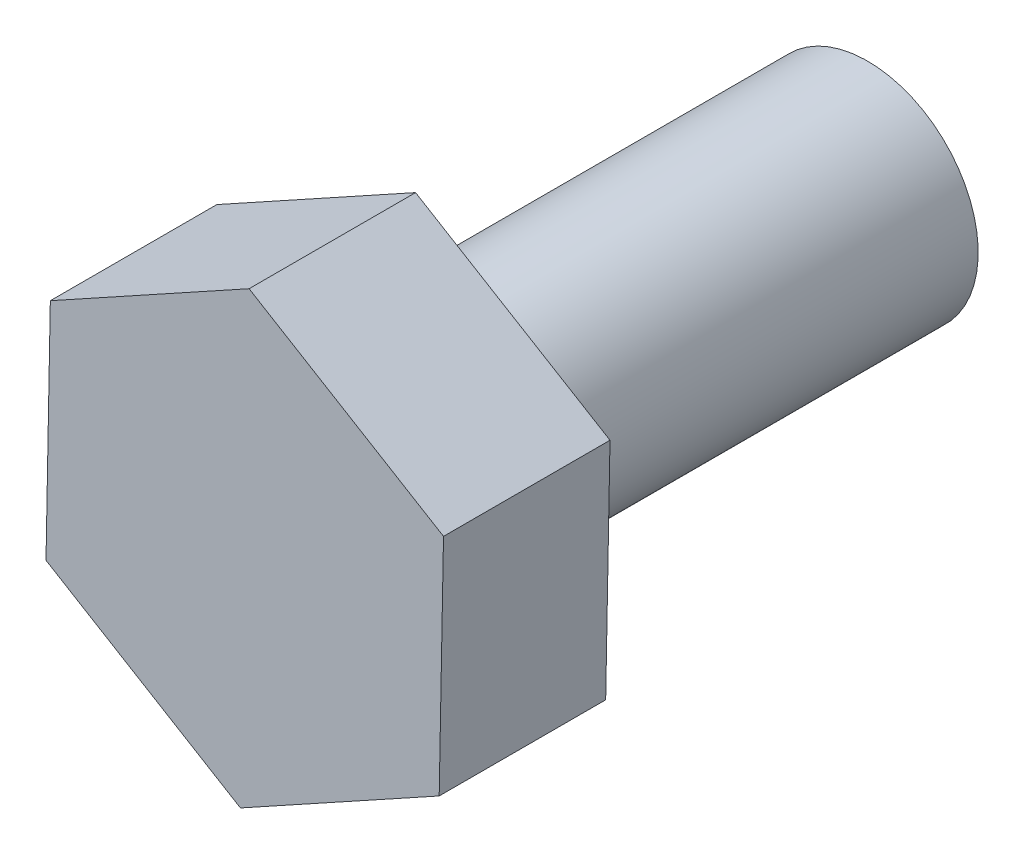
ISO-10303-21;
HEADER;
FILE_DESCRIPTION(('STEP AP214'),'2;1');
FILE_NAME('part.step','',(''),(''),'','','');
FILE_SCHEMA(('AUTOMOTIVE_DESIGN { 1 0 10303 214 1 1 1 1 }'));
ENDSEC;
DATA;
#1=APPLICATION_CONTEXT('core data for automotive mechanical design processes');
#2=APPLICATION_PROTOCOL_DEFINITION('international standard','automotive_design',2000,#1);
#3=PRODUCT_CONTEXT('',#1,'mechanical');
#4=PRODUCT('Part','Part','',(#3));
#5=PRODUCT_RELATED_PRODUCT_CATEGORY('part','',(#4));
#6=PRODUCT_DEFINITION_FORMATION('','',#4);
#7=PRODUCT_DEFINITION_CONTEXT('part definition',#1,'design');
#8=PRODUCT_DEFINITION('design','',#6,#7);
#9=PRODUCT_DEFINITION_SHAPE('','',#8);
#10=(LENGTH_UNIT() NAMED_UNIT(*) SI_UNIT(.MILLI.,.METRE.));
#11=(NAMED_UNIT(*) PLANE_ANGLE_UNIT() SI_UNIT($,.RADIAN.));
#12=(NAMED_UNIT(*) SI_UNIT($,.STERADIAN.) SOLID_ANGLE_UNIT());
#13=UNCERTAINTY_MEASURE_WITH_UNIT(LENGTH_MEASURE(1.E-05),#10,'distance_accuracy_value','');
#14=(GEOMETRIC_REPRESENTATION_CONTEXT(3) GLOBAL_UNCERTAINTY_ASSIGNED_CONTEXT((#13)) GLOBAL_UNIT_ASSIGNED_CONTEXT((#10,
#11,#12)) REPRESENTATION_CONTEXT('',''));
#15=CARTESIAN_POINT('',(0.,0.,0.));
#16=DIRECTION('',(0.,0.,1.));
#17=DIRECTION('',(1.,0.,0.));
#18=AXIS2_PLACEMENT_3D('',#15,#16,#17);
#19=CARTESIAN_POINT('',(-0.0811230383379181,-3.87413281363667,-2.9));
#20=DIRECTION('',(0.483401221702302,-0.875398914128137,0.));
#21=DIRECTION('',(0.875398914128137,0.483401221702302,0.));
#22=AXIS2_PLACEMENT_3D('',#19,#20,#21);
#23=PLANE('',#22);
#24=DIRECTION('',(0.875398914128137,0.483401221702302,0.));
#25=VECTOR('',#24,1.);
#26=CARTESIAN_POINT('',(-0.0811230383379181,-3.87413281363667,0.));
#27=LINE('',#26,#25);
#28=CARTESIAN_POINT('',(-0.0811230383379181,-3.87413281363667,0.));
#29=VERTEX_POINT('',#28);
#30=CARTESIAN_POINT('',(3.38094778289536,-1.96235380912321,0.));
#31=VERTEX_POINT('',#30);
#32=EDGE_CURVE('E132',#29,#31,#27,.T.);
#33=ORIENTED_EDGE('',*,*,#32,.F.);
#34=DIRECTION('',(0.,0.,1.));
#35=VECTOR('',#34,1.);
#36=CARTESIAN_POINT('',(-0.0811230383379181,-3.87413281363667,-2.9));
#37=LINE('',#36,#35);
#38=CARTESIAN_POINT('',(-0.0811230383379181,-3.87413281363667,-2.9));
#39=VERTEX_POINT('',#38);
#40=EDGE_CURVE('E49',#39,#29,#37,.T.);
#41=ORIENTED_EDGE('',*,*,#40,.F.);
#42=DIRECTION('',(0.875398914128137,0.483401221702302,0.));
#43=VECTOR('',#42,1.);
#44=CARTESIAN_POINT('',(-0.0811230383379181,-3.87413281363667,-2.9));
#45=LINE('',#44,#43);
#46=CARTESIAN_POINT('',(3.38094778289536,-1.96235380912321,-2.9));
#47=VERTEX_POINT('',#46);
#48=EDGE_CURVE('E154',#39,#47,#45,.T.);
#49=ORIENTED_EDGE('',*,*,#48,.T.);
#50=DIRECTION('',(0.,0.,1.));
#51=VECTOR('',#50,1.);
#52=CARTESIAN_POINT('',(3.38094778289536,-1.96235380912321,-2.9));
#53=LINE('',#52,#51);
#54=EDGE_CURVE('E42',#47,#31,#53,.T.);
#55=ORIENTED_EDGE('',*,*,#54,.T.);
#56=EDGE_LOOP('',(#33,#41,#49,#55));
#57=FACE_BOUND('',#56,.T.);
#58=ADVANCED_FACE('F39',(#57),#23,.T.);
#59=CARTESIAN_POINT('',(-3.46780763328494,-1.83178103500453,-2.9));
#60=DIRECTION('',(-0.516417087229128,-0.856337195278696,0.));
#61=DIRECTION('',(0.856337195278696,-0.516417087229128,0.));
#62=AXIS2_PLACEMENT_3D('',#59,#60,#61);
#63=PLANE('',#62);
#64=DIRECTION('',(0.856337195278695,-0.516417087229128,0.));
#65=VECTOR('',#64,1.);
#66=CARTESIAN_POINT('',(-3.46780763328494,-1.83178103500453,0.));
#67=LINE('',#66,#65);
#68=CARTESIAN_POINT('',(-3.46780763328494,-1.83178103500453,0.));
#69=VERTEX_POINT('',#68);
#70=EDGE_CURVE('E150',#69,#29,#67,.T.);
#71=ORIENTED_EDGE('',*,*,#70,.F.);
#72=DIRECTION('',(0.,0.,1.));
#73=VECTOR('',#72,1.);
#74=CARTESIAN_POINT('',(-3.46780763328494,-1.83178103500453,-2.9));
#75=LINE('',#74,#73);
#76=CARTESIAN_POINT('',(-3.46780763328494,-1.83178103500453,-2.9));
#77=VERTEX_POINT('',#76);
#78=EDGE_CURVE('E80',#77,#69,#75,.T.);
#79=ORIENTED_EDGE('',*,*,#78,.F.);
#80=DIRECTION('',(0.856337195278695,-0.516417087229128,0.));
#81=VECTOR('',#80,1.);
#82=CARTESIAN_POINT('',(-3.46780763328494,-1.83178103500453,-2.9));
#83=LINE('',#82,#81);
#84=EDGE_CURVE('E118',#77,#39,#83,.T.);
#85=ORIENTED_EDGE('',*,*,#84,.T.);
#86=ORIENTED_EDGE('',*,*,#40,.T.);
#87=EDGE_LOOP('',(#71,#79,#85,#86));
#88=FACE_BOUND('',#87,.T.);
#89=ADVANCED_FACE('F167',(#88),#63,.T.);
#90=CARTESIAN_POINT('',(-3.39242140699869,2.12234974814107,-2.9));
#91=DIRECTION('',(-0.99981830893143,0.0190617188494415,0.));
#92=DIRECTION('',(-0.0190617188494415,-0.99981830893143,0.));
#93=AXIS2_PLACEMENT_3D('',#90,#91,#92);
#94=PLANE('',#93);
#95=DIRECTION('',(-0.0190617188494415,-0.99981830893143,0.));
#96=VECTOR('',#95,1.);
#97=CARTESIAN_POINT('',(-3.39242140699869,2.12234974814107,0.));
#98=LINE('',#97,#96);
#99=CARTESIAN_POINT('',(-3.39242140699869,2.12234974814107,0.));
#100=VERTEX_POINT('',#99);
#101=EDGE_CURVE('E104',#100,#69,#98,.T.);
#102=ORIENTED_EDGE('',*,*,#101,.F.);
#103=DIRECTION('',(0.,0.,1.));
#104=VECTOR('',#103,1.);
#105=CARTESIAN_POINT('',(-3.39242140699869,2.12234974814107,-2.9));
#106=LINE('',#105,#104);
#107=CARTESIAN_POINT('',(-3.39242140699869,2.12234974814107,-2.9));
#108=VERTEX_POINT('',#107);
#109=EDGE_CURVE('E99',#108,#100,#106,.T.);
#110=ORIENTED_EDGE('',*,*,#109,.F.);
#111=DIRECTION('',(-0.0190617188494415,-0.99981830893143,0.));
#112=VECTOR('',#111,1.);
#113=CARTESIAN_POINT('',(-3.39242140699869,2.12234974814107,-2.9));
#114=LINE('',#113,#112);
#115=EDGE_CURVE('E102',#108,#77,#114,.T.);
#116=ORIENTED_EDGE('',*,*,#115,.T.);
#117=ORIENTED_EDGE('',*,*,#78,.T.);
#118=EDGE_LOOP('',(#102,#110,#116,#117));
#119=FACE_BOUND('',#118,.T.);
#120=ADVANCED_FACE('F101',(#119),#94,.T.);
#121=CARTESIAN_POINT('',(0.0696494142345891,4.03412875265453,-2.9));
#122=DIRECTION('',(-0.483401221702302,0.875398914128137,0.));
#123=DIRECTION('',(-0.875398914128137,-0.483401221702302,0.));
#124=AXIS2_PLACEMENT_3D('',#121,#122,#123);
#125=PLANE('',#124);
#126=DIRECTION('',(-0.875398914128137,-0.483401221702302,0.));
#127=VECTOR('',#126,1.);
#128=CARTESIAN_POINT('',(0.0696494142345891,4.03412875265453,0.));
#129=LINE('',#128,#127);
#130=CARTESIAN_POINT('',(0.0696494142345891,4.03412875265453,0.));
#131=VERTEX_POINT('',#130);
#132=EDGE_CURVE('E145',#131,#100,#129,.T.);
#133=ORIENTED_EDGE('',*,*,#132,.F.);
#134=DIRECTION('',(0.,0.,1.));
#135=VECTOR('',#134,1.);
#136=CARTESIAN_POINT('',(0.0696494142345891,4.03412875265453,-2.9));
#137=LINE('',#136,#135);
#138=CARTESIAN_POINT('',(0.0696494142345891,4.03412875265453,-2.9));
#139=VERTEX_POINT('',#138);
#140=EDGE_CURVE('E110',#139,#131,#137,.T.);
#141=ORIENTED_EDGE('',*,*,#140,.F.);
#142=DIRECTION('',(-0.875398914128137,-0.483401221702302,0.));
#143=VECTOR('',#142,1.);
#144=CARTESIAN_POINT('',(0.0696494142345891,4.03412875265453,-2.9));
#145=LINE('',#144,#143);
#146=EDGE_CURVE('E116',#139,#108,#145,.T.);
#147=ORIENTED_EDGE('',*,*,#146,.T.);
#148=ORIENTED_EDGE('',*,*,#109,.T.);
#149=EDGE_LOOP('',(#133,#141,#147,#148));
#150=FACE_BOUND('',#149,.T.);
#151=ADVANCED_FACE('F121',(#150),#125,.T.);
#152=CARTESIAN_POINT('',(3.45633400918161,1.99177697402239,-2.9));
#153=DIRECTION('',(0.516417087229128,0.856337195278696,0.));
#154=DIRECTION('',(-0.856337195278696,0.516417087229128,0.));
#155=AXIS2_PLACEMENT_3D('',#152,#153,#154);
#156=PLANE('',#155);
#157=DIRECTION('',(-0.856337195278696,0.516417087229128,0.));
#158=VECTOR('',#157,1.);
#159=CARTESIAN_POINT('',(3.45633400918161,1.99177697402239,0.));
#160=LINE('',#159,#158);
#161=CARTESIAN_POINT('',(3.45633400918161,1.99177697402239,0.));
#162=VERTEX_POINT('',#161);
#163=EDGE_CURVE('E141',#162,#131,#160,.T.);
#164=ORIENTED_EDGE('',*,*,#163,.F.);
#165=DIRECTION('',(0.,0.,1.));
#166=VECTOR('',#165,1.);
#167=CARTESIAN_POINT('',(3.45633400918161,1.99177697402239,-2.9));
#168=LINE('',#167,#166);
#169=CARTESIAN_POINT('',(3.45633400918161,1.99177697402239,-2.9));
#170=VERTEX_POINT('',#169);
#171=EDGE_CURVE('E160',#170,#162,#168,.T.);
#172=ORIENTED_EDGE('',*,*,#171,.F.);
#173=DIRECTION('',(-0.856337195278696,0.516417087229128,0.));
#174=VECTOR('',#173,1.);
#175=CARTESIAN_POINT('',(3.45633400918161,1.99177697402239,-2.9));
#176=LINE('',#175,#174);
#177=EDGE_CURVE('E123',#170,#139,#176,.T.);
#178=ORIENTED_EDGE('',*,*,#177,.T.);
#179=ORIENTED_EDGE('',*,*,#140,.T.);
#180=EDGE_LOOP('',(#164,#172,#178,#179));
#181=FACE_BOUND('',#180,.T.);
#182=ADVANCED_FACE('F180',(#181),#156,.T.);
#183=CARTESIAN_POINT('',(3.38094778289536,-1.96235380912321,-2.9));
#184=DIRECTION('',(0.99981830893143,-0.0190617188494414,0.));
#185=DIRECTION('',(0.0190617188494414,0.99981830893143,0.));
#186=AXIS2_PLACEMENT_3D('',#183,#184,#185);
#187=PLANE('',#186);
#188=DIRECTION('',(0.0190617188494414,0.99981830893143,0.));
#189=VECTOR('',#188,1.);
#190=CARTESIAN_POINT('',(3.38094778289536,-1.96235380912321,0.));
#191=LINE('',#190,#189);
#192=EDGE_CURVE('E136',#31,#162,#191,.T.);
#193=ORIENTED_EDGE('',*,*,#192,.F.);
#194=ORIENTED_EDGE('',*,*,#54,.F.);
#195=DIRECTION('',(0.0190617188494414,0.99981830893143,0.));
#196=VECTOR('',#195,1.);
#197=CARTESIAN_POINT('',(3.38094778289536,-1.96235380912321,-2.9));
#198=LINE('',#197,#196);
#199=EDGE_CURVE('E126',#47,#170,#198,.T.);
#200=ORIENTED_EDGE('',*,*,#199,.T.);
#201=ORIENTED_EDGE('',*,*,#171,.T.);
#202=EDGE_LOOP('',(#193,#194,#200,#201));
#203=FACE_BOUND('',#202,.T.);
#204=ADVANCED_FACE('F164',(#203),#187,.T.);
#205=CARTESIAN_POINT('',(0.,0.,-2.9));
#206=DIRECTION('',(0.,0.,1.));
#207=DIRECTION('',(1.,0.,0.));
#208=AXIS2_PLACEMENT_3D('',#205,#206,#207);
#209=PLANE('',#208);
#210=CARTESIAN_POINT('',(-0.0057368120516656,0.0799979695089294,-2.9));
#211=DIRECTION('',(0.,0.,-1.));
#212=DIRECTION('',(-1.,0.,0.));
#213=AXIS2_PLACEMENT_3D('',#210,#211,#212);
#214=CIRCLE('',#213,1.925);
#215=CARTESIAN_POINT('',(-1.93073681205167,0.0799979695089294,-2.9));
#216=VERTEX_POINT('',#215);
#217=EDGE_CURVE('E11',#216,#216,#214,.T.);
#218=ORIENTED_EDGE('',*,*,#217,.F.);
#219=EDGE_LOOP('',(#218));
#220=FACE_BOUND('',#219,.T.);
#221=ORIENTED_EDGE('',*,*,#48,.F.);
#222=ORIENTED_EDGE('',*,*,#84,.F.);
#223=ORIENTED_EDGE('',*,*,#115,.F.);
#224=ORIENTED_EDGE('',*,*,#146,.F.);
#225=ORIENTED_EDGE('',*,*,#177,.F.);
#226=ORIENTED_EDGE('',*,*,#199,.F.);
#227=EDGE_LOOP('',(#221,#222,#223,#224,#225,#226));
#228=FACE_BOUND('',#227,.T.);
#229=ADVANCED_FACE('F114',(#220,#228),#209,.F.);
#230=CARTESIAN_POINT('',(0.,0.,0.));
#231=DIRECTION('',(0.,0.,1.));
#232=DIRECTION('',(1.,0.,0.));
#233=AXIS2_PLACEMENT_3D('',#230,#231,#232);
#234=PLANE('',#233);
#235=ORIENTED_EDGE('',*,*,#32,.T.);
#236=ORIENTED_EDGE('',*,*,#192,.T.);
#237=ORIENTED_EDGE('',*,*,#163,.T.);
#238=ORIENTED_EDGE('',*,*,#132,.T.);
#239=ORIENTED_EDGE('',*,*,#101,.T.);
#240=ORIENTED_EDGE('',*,*,#70,.T.);
#241=EDGE_LOOP('',(#235,#236,#237,#238,#239,#240));
#242=FACE_BOUND('',#241,.T.);
#243=ADVANCED_FACE('F166',(#242),#234,.T.);
#244=CARTESIAN_POINT('',(-0.0057368120516656,0.0799979695089294,-10.85));
#245=DIRECTION('',(0.,0.,1.));
#246=DIRECTION('',(1.,0.,0.));
#247=AXIS2_PLACEMENT_3D('',#244,#245,#246);
#248=CYLINDRICAL_SURFACE('',#247,1.925);
#249=CARTESIAN_POINT('',(-0.0057368120516656,0.0799979695089294,-10.85));
#250=DIRECTION('',(0.,0.,-1.));
#251=DIRECTION('',(-1.,0.,0.));
#252=AXIS2_PLACEMENT_3D('',#249,#250,#251);
#253=CIRCLE('',#252,1.925);
#254=CARTESIAN_POINT('',(-1.93073681205167,0.0799979695089294,-10.85));
#255=VERTEX_POINT('',#254);
#256=EDGE_CURVE('E137',#255,#255,#253,.T.);
#257=ORIENTED_EDGE('',*,*,#256,.F.);
#258=EDGE_LOOP('',(#257));
#259=FACE_BOUND('',#258,.T.);
#260=ORIENTED_EDGE('',*,*,#217,.T.);
#261=EDGE_LOOP('',(#260));
#262=FACE_BOUND('',#261,.T.);
#263=ADVANCED_FACE('F191',(#259,#262),#248,.T.);
#264=CARTESIAN_POINT('',(-0.0057368120516656,0.0799979695089294,-10.85));
#265=DIRECTION('',(0.,0.,-1.));
#266=DIRECTION('',(-1.,0.,0.));
#267=AXIS2_PLACEMENT_3D('',#264,#265,#266);
#268=PLANE('',#267);
#269=ORIENTED_EDGE('',*,*,#256,.T.);
#270=EDGE_LOOP('',(#269));
#271=FACE_BOUND('',#270,.T.);
#272=ADVANCED_FACE('F196',(#271),#268,.T.);
#273=CLOSED_SHELL('',(#58,#89,#120,#151,#182,#204,#229,#243,#263,#272));
#274=MANIFOLD_SOLID_BREP('B2',#273);
#275=ADVANCED_BREP_SHAPE_REPRESENTATION('',(#18,#274),#14);
#276=SHAPE_DEFINITION_REPRESENTATION(#9,#275);
ENDSEC;
END-ISO-10303-21;
